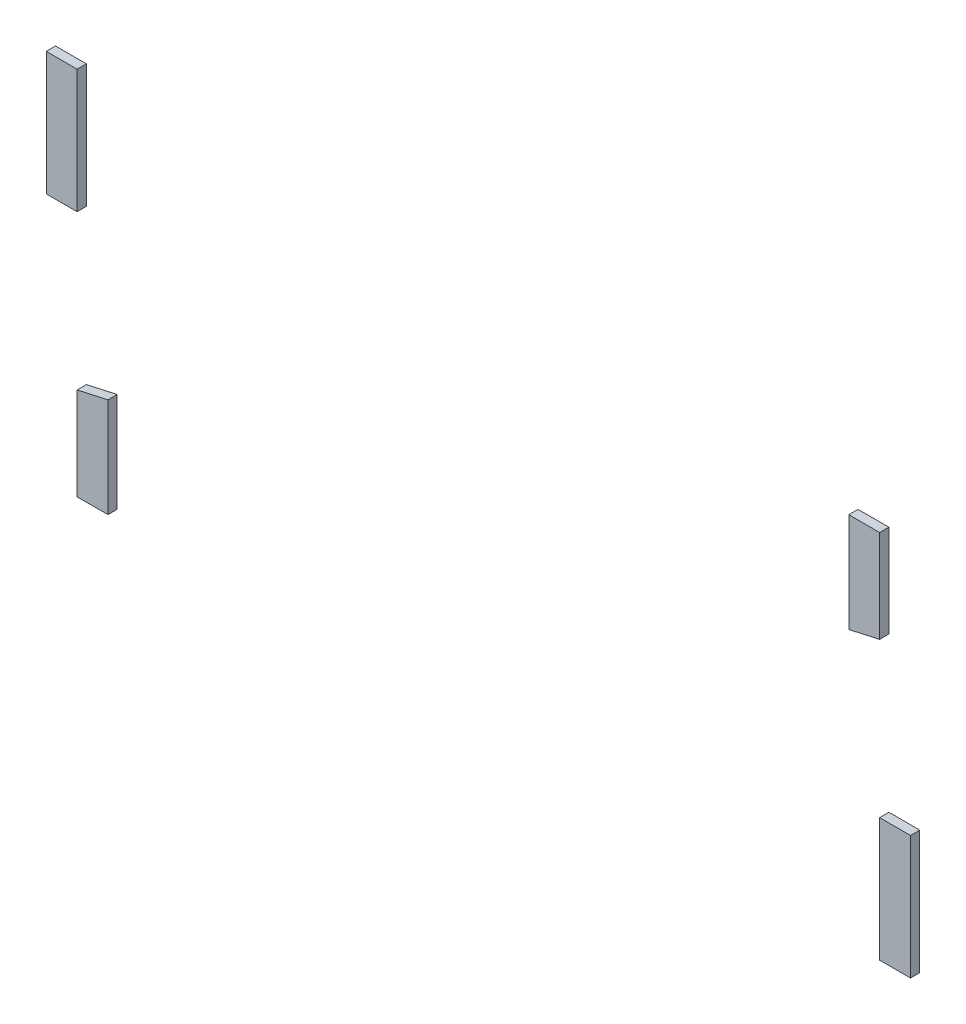
ISO-10303-21;
HEADER;
FILE_DESCRIPTION(('STEP AP214'),'2;1');
FILE_NAME('part.step','',(''),(''),'','','');
FILE_SCHEMA(('AUTOMOTIVE_DESIGN { 1 0 10303 214 1 1 1 1 }'));
ENDSEC;
DATA;
#1=APPLICATION_CONTEXT('core data for automotive mechanical design processes');
#2=APPLICATION_PROTOCOL_DEFINITION('international standard','automotive_design',2000,#1);
#3=PRODUCT_CONTEXT('',#1,'mechanical');
#4=PRODUCT('Part','Part','',(#3));
#5=PRODUCT_RELATED_PRODUCT_CATEGORY('part','',(#4));
#6=PRODUCT_DEFINITION_FORMATION('','',#4);
#7=PRODUCT_DEFINITION_CONTEXT('part definition',#1,'design');
#8=PRODUCT_DEFINITION('design','',#6,#7);
#9=PRODUCT_DEFINITION_SHAPE('','',#8);
#10=(LENGTH_UNIT() NAMED_UNIT(*) SI_UNIT(.MILLI.,.METRE.));
#11=(NAMED_UNIT(*) PLANE_ANGLE_UNIT() SI_UNIT($,.RADIAN.));
#12=(NAMED_UNIT(*) SI_UNIT($,.STERADIAN.) SOLID_ANGLE_UNIT());
#13=UNCERTAINTY_MEASURE_WITH_UNIT(LENGTH_MEASURE(1.E-05),#10,'distance_accuracy_value','');
#14=(GEOMETRIC_REPRESENTATION_CONTEXT(3) GLOBAL_UNCERTAINTY_ASSIGNED_CONTEXT((#13)) GLOBAL_UNIT_ASSIGNED_CONTEXT((#10,
#11,#12)) REPRESENTATION_CONTEXT('',''));
#15=CARTESIAN_POINT('',(0.,0.,0.));
#16=DIRECTION('',(0.,0.,1.));
#17=DIRECTION('',(1.,0.,0.));
#18=AXIS2_PLACEMENT_3D('',#15,#16,#17);
#19=CARTESIAN_POINT('',(32.5,-5.,0.75));
#20=DIRECTION('',(1.,0.,0.));
#21=DIRECTION('',(0.,0.,-1.));
#22=AXIS2_PLACEMENT_3D('',#19,#20,#21);
#23=PLANE('',#22);
#24=DIRECTION('',(0.,-1.,0.));
#25=VECTOR('',#24,1.);
#26=CARTESIAN_POINT('',(32.5,-5.,0.));
#27=LINE('',#26,#25);
#28=CARTESIAN_POINT('',(32.5,-5.,0.));
#29=VERTEX_POINT('',#28);
#30=CARTESIAN_POINT('',(32.5,-15.,0.));
#31=VERTEX_POINT('',#30);
#32=EDGE_CURVE('E107',#29,#31,#27,.T.);
#33=ORIENTED_EDGE('',*,*,#32,.T.);
#34=DIRECTION('',(0.,0.,-1.));
#35=VECTOR('',#34,1.);
#36=CARTESIAN_POINT('',(32.5,-15.,0.75));
#37=LINE('',#36,#35);
#38=CARTESIAN_POINT('',(32.5,-15.,0.75));
#39=VERTEX_POINT('',#38);
#40=EDGE_CURVE('E12',#39,#31,#37,.T.);
#41=ORIENTED_EDGE('',*,*,#40,.F.);
#42=DIRECTION('',(0.,-1.,0.));
#43=VECTOR('',#42,1.);
#44=CARTESIAN_POINT('',(32.5,-5.,0.75));
#45=LINE('',#44,#43);
#46=CARTESIAN_POINT('',(32.5,-5.,0.75));
#47=VERTEX_POINT('',#46);
#48=EDGE_CURVE('E95',#47,#39,#45,.T.);
#49=ORIENTED_EDGE('',*,*,#48,.F.);
#50=DIRECTION('',(0.,0.,-1.));
#51=VECTOR('',#50,1.);
#52=CARTESIAN_POINT('',(32.5,-5.,0.75));
#53=LINE('',#52,#51);
#54=EDGE_CURVE('E103',#47,#29,#53,.T.);
#55=ORIENTED_EDGE('',*,*,#54,.T.);
#56=EDGE_LOOP('',(#33,#41,#49,#55));
#57=FACE_BOUND('',#56,.T.);
#58=ADVANCED_FACE('F44',(#57),#23,.F.);
#59=CARTESIAN_POINT('',(32.5,-15.,0.75));
#60=DIRECTION('',(0.,1.,0.));
#61=DIRECTION('',(0.,0.,1.));
#62=AXIS2_PLACEMENT_3D('',#59,#60,#61);
#63=PLANE('',#62);
#64=DIRECTION('',(1.,0.,0.));
#65=VECTOR('',#64,1.);
#66=CARTESIAN_POINT('',(32.5,-15.,0.));
#67=LINE('',#66,#65);
#68=CARTESIAN_POINT('',(35.,-15.,0.));
#69=VERTEX_POINT('',#68);
#70=EDGE_CURVE('E99',#31,#69,#67,.T.);
#71=ORIENTED_EDGE('',*,*,#70,.T.);
#72=DIRECTION('',(0.,0.,-1.));
#73=VECTOR('',#72,1.);
#74=CARTESIAN_POINT('',(35.,-15.,0.75));
#75=LINE('',#74,#73);
#76=CARTESIAN_POINT('',(35.,-15.,0.75));
#77=VERTEX_POINT('',#76);
#78=EDGE_CURVE('E52',#77,#69,#75,.T.);
#79=ORIENTED_EDGE('',*,*,#78,.F.);
#80=DIRECTION('',(1.,0.,0.));
#81=VECTOR('',#80,1.);
#82=CARTESIAN_POINT('',(32.5,-15.,0.75));
#83=LINE('',#82,#81);
#84=EDGE_CURVE('E90',#39,#77,#83,.T.);
#85=ORIENTED_EDGE('',*,*,#84,.F.);
#86=ORIENTED_EDGE('',*,*,#40,.T.);
#87=EDGE_LOOP('',(#71,#79,#85,#86));
#88=FACE_BOUND('',#87,.T.);
#89=ADVANCED_FACE('F98',(#88),#63,.F.);
#90=CARTESIAN_POINT('',(35.,-5.,0.75));
#91=DIRECTION('',(-1.,0.,0.));
#92=DIRECTION('',(0.,0.,1.));
#93=AXIS2_PLACEMENT_3D('',#90,#91,#92);
#94=PLANE('',#93);
#95=DIRECTION('',(0.,1.,0.));
#96=VECTOR('',#95,1.);
#97=CARTESIAN_POINT('',(35.,-5.,0.));
#98=LINE('',#97,#96);
#99=CARTESIAN_POINT('',(35.,-5.,0.));
#100=VERTEX_POINT('',#99);
#101=EDGE_CURVE('E77',#69,#100,#98,.T.);
#102=ORIENTED_EDGE('',*,*,#101,.T.);
#103=DIRECTION('',(0.,0.,-1.));
#104=VECTOR('',#103,1.);
#105=CARTESIAN_POINT('',(35.,-5.,0.75));
#106=LINE('',#105,#104);
#107=CARTESIAN_POINT('',(35.,-5.,0.75));
#108=VERTEX_POINT('',#107);
#109=EDGE_CURVE('E100',#108,#100,#106,.T.);
#110=ORIENTED_EDGE('',*,*,#109,.F.);
#111=DIRECTION('',(0.,1.,0.));
#112=VECTOR('',#111,1.);
#113=CARTESIAN_POINT('',(35.,-5.,0.75));
#114=LINE('',#113,#112);
#115=EDGE_CURVE('E93',#77,#108,#114,.T.);
#116=ORIENTED_EDGE('',*,*,#115,.F.);
#117=ORIENTED_EDGE('',*,*,#78,.T.);
#118=EDGE_LOOP('',(#102,#110,#116,#117));
#119=FACE_BOUND('',#118,.T.);
#120=ADVANCED_FACE('F101',(#119),#94,.F.);
#121=CARTESIAN_POINT('',(32.5,-5.,0.75));
#122=DIRECTION('',(0.,-1.,0.));
#123=DIRECTION('',(0.,0.,-1.));
#124=AXIS2_PLACEMENT_3D('',#121,#122,#123);
#125=PLANE('',#124);
#126=DIRECTION('',(-1.,0.,0.));
#127=VECTOR('',#126,1.);
#128=CARTESIAN_POINT('',(32.5,-5.,0.));
#129=LINE('',#128,#127);
#130=EDGE_CURVE('E83',#100,#29,#129,.T.);
#131=ORIENTED_EDGE('',*,*,#130,.T.);
#132=ORIENTED_EDGE('',*,*,#54,.F.);
#133=DIRECTION('',(-1.,0.,0.));
#134=VECTOR('',#133,1.);
#135=CARTESIAN_POINT('',(32.5,-5.,0.75));
#136=LINE('',#135,#134);
#137=EDGE_CURVE('E60',#108,#47,#136,.T.);
#138=ORIENTED_EDGE('',*,*,#137,.F.);
#139=ORIENTED_EDGE('',*,*,#109,.T.);
#140=EDGE_LOOP('',(#131,#132,#138,#139));
#141=FACE_BOUND('',#140,.T.);
#142=ADVANCED_FACE('F114',(#141),#125,.F.);
#143=CARTESIAN_POINT('',(0.,0.,0.75));
#144=DIRECTION('',(0.,0.,1.));
#145=DIRECTION('',(1.,0.,0.));
#146=AXIS2_PLACEMENT_3D('',#143,#144,#145);
#147=PLANE('',#146);
#148=ORIENTED_EDGE('',*,*,#48,.T.);
#149=ORIENTED_EDGE('',*,*,#84,.T.);
#150=ORIENTED_EDGE('',*,*,#115,.T.);
#151=ORIENTED_EDGE('',*,*,#137,.T.);
#152=EDGE_LOOP('',(#148,#149,#150,#151));
#153=FACE_BOUND('',#152,.T.);
#154=ADVANCED_FACE('F91',(#153),#147,.T.);
#155=CARTESIAN_POINT('',(0.,0.,0.));
#156=DIRECTION('',(0.,0.,1.));
#157=DIRECTION('',(1.,0.,0.));
#158=AXIS2_PLACEMENT_3D('',#155,#156,#157);
#159=PLANE('',#158);
#160=ORIENTED_EDGE('',*,*,#32,.F.);
#161=ORIENTED_EDGE('',*,*,#130,.F.);
#162=ORIENTED_EDGE('',*,*,#101,.F.);
#163=ORIENTED_EDGE('',*,*,#70,.F.);
#164=EDGE_LOOP('',(#160,#161,#162,#163));
#165=FACE_BOUND('',#164,.T.);
#166=ADVANCED_FACE('F117',(#165),#159,.F.);
#167=CLOSED_SHELL('',(#58,#89,#120,#142,#154,#166));
#168=MANIFOLD_SOLID_BREP('B2',#167);
#169=CARTESIAN_POINT('',(-30.,-6.94444444444444,0.75));
#170=DIRECTION('',(-1.,0.,0.));
#171=DIRECTION('',(0.,-1.,0.));
#172=AXIS2_PLACEMENT_3D('',#169,#170,#171);
#173=PLANE('',#172);
#174=DIRECTION('',(0.,1.,0.));
#175=VECTOR('',#174,1.);
#176=CARTESIAN_POINT('',(-30.,-6.94444444444444,0.));
#177=LINE('',#176,#175);
#178=CARTESIAN_POINT('',(-30.,-15.,0.));
#179=VERTEX_POINT('',#178);
#180=CARTESIAN_POINT('',(-30.,-6.94444444444444,0.));
#181=VERTEX_POINT('',#180);
#182=EDGE_CURVE('E241',#179,#181,#177,.T.);
#183=ORIENTED_EDGE('',*,*,#182,.T.);
#184=DIRECTION('',(0.,0.,-1.));
#185=VECTOR('',#184,1.);
#186=CARTESIAN_POINT('',(-30.,-6.94444444444444,0.75));
#187=LINE('',#186,#185);
#188=CARTESIAN_POINT('',(-30.,-6.94444444444444,0.75));
#189=VERTEX_POINT('',#188);
#190=EDGE_CURVE('E42',#189,#181,#187,.T.);
#191=ORIENTED_EDGE('',*,*,#190,.F.);
#192=DIRECTION('',(0.,1.,0.));
#193=VECTOR('',#192,1.);
#194=CARTESIAN_POINT('',(-30.,-6.94444444444444,0.75));
#195=LINE('',#194,#193);
#196=CARTESIAN_POINT('',(-30.,-15.,0.75));
#197=VERTEX_POINT('',#196);
#198=EDGE_CURVE('E229',#197,#189,#195,.T.);
#199=ORIENTED_EDGE('',*,*,#198,.F.);
#200=DIRECTION('',(0.,0.,-1.));
#201=VECTOR('',#200,1.);
#202=CARTESIAN_POINT('',(-30.,-15.,0.75));
#203=LINE('',#202,#201);
#204=EDGE_CURVE('E237',#197,#179,#203,.T.);
#205=ORIENTED_EDGE('',*,*,#204,.T.);
#206=EDGE_LOOP('',(#183,#191,#199,#205));
#207=FACE_BOUND('',#206,.T.);
#208=ADVANCED_FACE('F178',(#207),#173,.F.);
#209=CARTESIAN_POINT('',(-30.,-6.94444444444444,0.75));
#210=DIRECTION('',(0.216930457818656,-0.976187060183953,0.));
#211=DIRECTION('',(0.976187060183953,0.216930457818656,0.));
#212=AXIS2_PLACEMENT_3D('',#209,#210,#211);
#213=PLANE('',#212);
#214=DIRECTION('',(-0.976187060183953,-0.216930457818656,0.));
#215=VECTOR('',#214,1.);
#216=CARTESIAN_POINT('',(-30.,-6.94444444444444,0.));
#217=LINE('',#216,#215);
#218=CARTESIAN_POINT('',(-32.5,-7.5,0.));
#219=VERTEX_POINT('',#218);
#220=EDGE_CURVE('E233',#181,#219,#217,.T.);
#221=ORIENTED_EDGE('',*,*,#220,.T.);
#222=DIRECTION('',(0.,0.,-1.));
#223=VECTOR('',#222,1.);
#224=CARTESIAN_POINT('',(-32.5,-7.5,0.75));
#225=LINE('',#224,#223);
#226=CARTESIAN_POINT('',(-32.5,-7.5,0.75));
#227=VERTEX_POINT('',#226);
#228=EDGE_CURVE('E186',#227,#219,#225,.T.);
#229=ORIENTED_EDGE('',*,*,#228,.F.);
#230=DIRECTION('',(-0.976187060183953,-0.216930457818656,0.));
#231=VECTOR('',#230,1.);
#232=CARTESIAN_POINT('',(-30.,-6.94444444444444,0.75));
#233=LINE('',#232,#231);
#234=EDGE_CURVE('E224',#189,#227,#233,.T.);
#235=ORIENTED_EDGE('',*,*,#234,.F.);
#236=ORIENTED_EDGE('',*,*,#190,.T.);
#237=EDGE_LOOP('',(#221,#229,#235,#236));
#238=FACE_BOUND('',#237,.T.);
#239=ADVANCED_FACE('F232',(#238),#213,.F.);
#240=CARTESIAN_POINT('',(-32.5,-7.5,0.75));
#241=DIRECTION('',(1.,0.,0.));
#242=DIRECTION('',(0.,0.,-1.));
#243=AXIS2_PLACEMENT_3D('',#240,#241,#242);
#244=PLANE('',#243);
#245=DIRECTION('',(0.,-1.,0.));
#246=VECTOR('',#245,1.);
#247=CARTESIAN_POINT('',(-32.5,-7.5,0.));
#248=LINE('',#247,#246);
#249=CARTESIAN_POINT('',(-32.5,-15.,0.));
#250=VERTEX_POINT('',#249);
#251=EDGE_CURVE('E211',#219,#250,#248,.T.);
#252=ORIENTED_EDGE('',*,*,#251,.T.);
#253=DIRECTION('',(0.,0.,-1.));
#254=VECTOR('',#253,1.);
#255=CARTESIAN_POINT('',(-32.5,-15.,0.75));
#256=LINE('',#255,#254);
#257=CARTESIAN_POINT('',(-32.5,-15.,0.75));
#258=VERTEX_POINT('',#257);
#259=EDGE_CURVE('E234',#258,#250,#256,.T.);
#260=ORIENTED_EDGE('',*,*,#259,.F.);
#261=DIRECTION('',(0.,-1.,0.));
#262=VECTOR('',#261,1.);
#263=CARTESIAN_POINT('',(-32.5,-7.5,0.75));
#264=LINE('',#263,#262);
#265=EDGE_CURVE('E227',#227,#258,#264,.T.);
#266=ORIENTED_EDGE('',*,*,#265,.F.);
#267=ORIENTED_EDGE('',*,*,#228,.T.);
#268=EDGE_LOOP('',(#252,#260,#266,#267));
#269=FACE_BOUND('',#268,.T.);
#270=ADVANCED_FACE('F235',(#269),#244,.F.);
#271=CARTESIAN_POINT('',(-32.5,-15.,0.75));
#272=DIRECTION('',(0.,1.,0.));
#273=DIRECTION('',(0.,0.,1.));
#274=AXIS2_PLACEMENT_3D('',#271,#272,#273);
#275=PLANE('',#274);
#276=DIRECTION('',(1.,0.,0.));
#277=VECTOR('',#276,1.);
#278=CARTESIAN_POINT('',(-32.5,-15.,0.));
#279=LINE('',#278,#277);
#280=EDGE_CURVE('E217',#250,#179,#279,.T.);
#281=ORIENTED_EDGE('',*,*,#280,.T.);
#282=ORIENTED_EDGE('',*,*,#204,.F.);
#283=DIRECTION('',(1.,0.,0.));
#284=VECTOR('',#283,1.);
#285=CARTESIAN_POINT('',(-32.5,-15.,0.75));
#286=LINE('',#285,#284);
#287=EDGE_CURVE('E194',#258,#197,#286,.T.);
#288=ORIENTED_EDGE('',*,*,#287,.F.);
#289=ORIENTED_EDGE('',*,*,#259,.T.);
#290=EDGE_LOOP('',(#281,#282,#288,#289));
#291=FACE_BOUND('',#290,.T.);
#292=ADVANCED_FACE('F248',(#291),#275,.F.);
#293=CARTESIAN_POINT('',(0.,0.,0.75));
#294=DIRECTION('',(0.,0.,1.));
#295=DIRECTION('',(1.,0.,0.));
#296=AXIS2_PLACEMENT_3D('',#293,#294,#295);
#297=PLANE('',#296);
#298=ORIENTED_EDGE('',*,*,#198,.T.);
#299=ORIENTED_EDGE('',*,*,#234,.T.);
#300=ORIENTED_EDGE('',*,*,#265,.T.);
#301=ORIENTED_EDGE('',*,*,#287,.T.);
#302=EDGE_LOOP('',(#298,#299,#300,#301));
#303=FACE_BOUND('',#302,.T.);
#304=ADVANCED_FACE('F225',(#303),#297,.T.);
#305=CARTESIAN_POINT('',(0.,0.,0.));
#306=DIRECTION('',(0.,0.,1.));
#307=DIRECTION('',(1.,0.,0.));
#308=AXIS2_PLACEMENT_3D('',#305,#306,#307);
#309=PLANE('',#308);
#310=ORIENTED_EDGE('',*,*,#182,.F.);
#311=ORIENTED_EDGE('',*,*,#280,.F.);
#312=ORIENTED_EDGE('',*,*,#251,.F.);
#313=ORIENTED_EDGE('',*,*,#220,.F.);
#314=EDGE_LOOP('',(#310,#311,#312,#313));
#315=FACE_BOUND('',#314,.T.);
#316=ADVANCED_FACE('F251',(#315),#309,.F.);
#317=CLOSED_SHELL('',(#208,#239,#270,#292,#304,#316));
#318=MANIFOLD_SOLID_BREP('B6',#317);
#319=CARTESIAN_POINT('',(30.,15.,0.75));
#320=DIRECTION('',(1.,0.,0.));
#321=DIRECTION('',(0.,0.,-1.));
#322=AXIS2_PLACEMENT_3D('',#319,#320,#321);
#323=PLANE('',#322);
#324=DIRECTION('',(0.,-1.,0.));
#325=VECTOR('',#324,1.);
#326=CARTESIAN_POINT('',(30.,15.,0.));
#327=LINE('',#326,#325);
#328=CARTESIAN_POINT('',(30.,15.,0.));
#329=VERTEX_POINT('',#328);
#330=CARTESIAN_POINT('',(30.,6.94444444444444,0.));
#331=VERTEX_POINT('',#330);
#332=EDGE_CURVE('E374',#329,#331,#327,.T.);
#333=ORIENTED_EDGE('',*,*,#332,.T.);
#334=DIRECTION('',(0.,0.,-1.));
#335=VECTOR('',#334,1.);
#336=CARTESIAN_POINT('',(30.,6.94444444444444,0.75));
#337=LINE('',#336,#335);
#338=CARTESIAN_POINT('',(30.,6.94444444444444,0.75));
#339=VERTEX_POINT('',#338);
#340=EDGE_CURVE('E176',#339,#331,#337,.T.);
#341=ORIENTED_EDGE('',*,*,#340,.F.);
#342=DIRECTION('',(0.,-1.,0.));
#343=VECTOR('',#342,1.);
#344=CARTESIAN_POINT('',(30.,15.,0.75));
#345=LINE('',#344,#343);
#346=CARTESIAN_POINT('',(30.,15.,0.75));
#347=VERTEX_POINT('',#346);
#348=EDGE_CURVE('E362',#347,#339,#345,.T.);
#349=ORIENTED_EDGE('',*,*,#348,.F.);
#350=DIRECTION('',(0.,0.,-1.));
#351=VECTOR('',#350,1.);
#352=CARTESIAN_POINT('',(30.,15.,0.75));
#353=LINE('',#352,#351);
#354=EDGE_CURVE('E370',#347,#329,#353,.T.);
#355=ORIENTED_EDGE('',*,*,#354,.T.);
#356=EDGE_LOOP('',(#333,#341,#349,#355));
#357=FACE_BOUND('',#356,.T.);
#358=ADVANCED_FACE('F311',(#357),#323,.F.);
#359=CARTESIAN_POINT('',(30.,6.94444444444444,0.75));
#360=DIRECTION('',(-0.216930457818656,0.976187060183953,0.));
#361=DIRECTION('',(-0.976187060183953,-0.216930457818656,0.));
#362=AXIS2_PLACEMENT_3D('',#359,#360,#361);
#363=PLANE('',#362);
#364=DIRECTION('',(0.976187060183953,0.216930457818656,0.));
#365=VECTOR('',#364,1.);
#366=CARTESIAN_POINT('',(30.,6.94444444444444,0.));
#367=LINE('',#366,#365);
#368=CARTESIAN_POINT('',(32.5,7.5,0.));
#369=VERTEX_POINT('',#368);
#370=EDGE_CURVE('E366',#331,#369,#367,.T.);
#371=ORIENTED_EDGE('',*,*,#370,.T.);
#372=DIRECTION('',(0.,0.,-1.));
#373=VECTOR('',#372,1.);
#374=CARTESIAN_POINT('',(32.5,7.5,0.75));
#375=LINE('',#374,#373);
#376=CARTESIAN_POINT('',(32.5,7.5,0.75));
#377=VERTEX_POINT('',#376);
#378=EDGE_CURVE('E319',#377,#369,#375,.T.);
#379=ORIENTED_EDGE('',*,*,#378,.F.);
#380=DIRECTION('',(0.976187060183953,0.216930457818656,0.));
#381=VECTOR('',#380,1.);
#382=CARTESIAN_POINT('',(30.,6.94444444444444,0.75));
#383=LINE('',#382,#381);
#384=EDGE_CURVE('E357',#339,#377,#383,.T.);
#385=ORIENTED_EDGE('',*,*,#384,.F.);
#386=ORIENTED_EDGE('',*,*,#340,.T.);
#387=EDGE_LOOP('',(#371,#379,#385,#386));
#388=FACE_BOUND('',#387,.T.);
#389=ADVANCED_FACE('F365',(#388),#363,.F.);
#390=CARTESIAN_POINT('',(32.5,15.,0.75));
#391=DIRECTION('',(-1.,0.,0.));
#392=DIRECTION('',(0.,0.,1.));
#393=AXIS2_PLACEMENT_3D('',#390,#391,#392);
#394=PLANE('',#393);
#395=DIRECTION('',(0.,1.,0.));
#396=VECTOR('',#395,1.);
#397=CARTESIAN_POINT('',(32.5,15.,0.));
#398=LINE('',#397,#396);
#399=CARTESIAN_POINT('',(32.5,15.,0.));
#400=VERTEX_POINT('',#399);
#401=EDGE_CURVE('E344',#369,#400,#398,.T.);
#402=ORIENTED_EDGE('',*,*,#401,.T.);
#403=DIRECTION('',(0.,0.,-1.));
#404=VECTOR('',#403,1.);
#405=CARTESIAN_POINT('',(32.5,15.,0.75));
#406=LINE('',#405,#404);
#407=CARTESIAN_POINT('',(32.5,15.,0.75));
#408=VERTEX_POINT('',#407);
#409=EDGE_CURVE('E367',#408,#400,#406,.T.);
#410=ORIENTED_EDGE('',*,*,#409,.F.);
#411=DIRECTION('',(0.,1.,0.));
#412=VECTOR('',#411,1.);
#413=CARTESIAN_POINT('',(32.5,15.,0.75));
#414=LINE('',#413,#412);
#415=EDGE_CURVE('E360',#377,#408,#414,.T.);
#416=ORIENTED_EDGE('',*,*,#415,.F.);
#417=ORIENTED_EDGE('',*,*,#378,.T.);
#418=EDGE_LOOP('',(#402,#410,#416,#417));
#419=FACE_BOUND('',#418,.T.);
#420=ADVANCED_FACE('F368',(#419),#394,.F.);
#421=CARTESIAN_POINT('',(30.,15.,0.75));
#422=DIRECTION('',(0.,-1.,0.));
#423=DIRECTION('',(0.,0.,-1.));
#424=AXIS2_PLACEMENT_3D('',#421,#422,#423);
#425=PLANE('',#424);
#426=DIRECTION('',(-1.,0.,0.));
#427=VECTOR('',#426,1.);
#428=CARTESIAN_POINT('',(30.,15.,0.));
#429=LINE('',#428,#427);
#430=EDGE_CURVE('E350',#400,#329,#429,.T.);
#431=ORIENTED_EDGE('',*,*,#430,.T.);
#432=ORIENTED_EDGE('',*,*,#354,.F.);
#433=DIRECTION('',(-1.,0.,0.));
#434=VECTOR('',#433,1.);
#435=CARTESIAN_POINT('',(30.,15.,0.75));
#436=LINE('',#435,#434);
#437=EDGE_CURVE('E327',#408,#347,#436,.T.);
#438=ORIENTED_EDGE('',*,*,#437,.F.);
#439=ORIENTED_EDGE('',*,*,#409,.T.);
#440=EDGE_LOOP('',(#431,#432,#438,#439));
#441=FACE_BOUND('',#440,.T.);
#442=ADVANCED_FACE('F381',(#441),#425,.F.);
#443=CARTESIAN_POINT('',(0.,0.,0.75));
#444=DIRECTION('',(0.,0.,1.));
#445=DIRECTION('',(1.,0.,0.));
#446=AXIS2_PLACEMENT_3D('',#443,#444,#445);
#447=PLANE('',#446);
#448=ORIENTED_EDGE('',*,*,#348,.T.);
#449=ORIENTED_EDGE('',*,*,#384,.T.);
#450=ORIENTED_EDGE('',*,*,#415,.T.);
#451=ORIENTED_EDGE('',*,*,#437,.T.);
#452=EDGE_LOOP('',(#448,#449,#450,#451));
#453=FACE_BOUND('',#452,.T.);
#454=ADVANCED_FACE('F358',(#453),#447,.T.);
#455=CARTESIAN_POINT('',(0.,0.,0.));
#456=DIRECTION('',(0.,0.,1.));
#457=DIRECTION('',(1.,0.,0.));
#458=AXIS2_PLACEMENT_3D('',#455,#456,#457);
#459=PLANE('',#458);
#460=ORIENTED_EDGE('',*,*,#332,.F.);
#461=ORIENTED_EDGE('',*,*,#430,.F.);
#462=ORIENTED_EDGE('',*,*,#401,.F.);
#463=ORIENTED_EDGE('',*,*,#370,.F.);
#464=EDGE_LOOP('',(#460,#461,#462,#463));
#465=FACE_BOUND('',#464,.T.);
#466=ADVANCED_FACE('F384',(#465),#459,.F.);
#467=CLOSED_SHELL('',(#358,#389,#420,#442,#454,#466));
#468=MANIFOLD_SOLID_BREP('B36',#467);
#469=CARTESIAN_POINT('',(-35.,15.,0.75));
#470=DIRECTION('',(1.,0.,0.));
#471=DIRECTION('',(0.,0.,-1.));
#472=AXIS2_PLACEMENT_3D('',#469,#470,#471);
#473=PLANE('',#472);
#474=DIRECTION('',(0.,-1.,0.));
#475=VECTOR('',#474,1.);
#476=CARTESIAN_POINT('',(-35.,15.,0.));
#477=LINE('',#476,#475);
#478=CARTESIAN_POINT('',(-35.,15.,0.));
#479=VERTEX_POINT('',#478);
#480=CARTESIAN_POINT('',(-35.,5.,0.));
#481=VERTEX_POINT('',#480);
#482=EDGE_CURVE('E498',#479,#481,#477,.T.);
#483=ORIENTED_EDGE('',*,*,#482,.T.);
#484=DIRECTION('',(0.,0.,-1.));
#485=VECTOR('',#484,1.);
#486=CARTESIAN_POINT('',(-35.,5.,0.75));
#487=LINE('',#486,#485);
#488=CARTESIAN_POINT('',(-35.,5.,0.75));
#489=VERTEX_POINT('',#488);
#490=EDGE_CURVE('E309',#489,#481,#487,.T.);
#491=ORIENTED_EDGE('',*,*,#490,.F.);
#492=DIRECTION('',(0.,-1.,0.));
#493=VECTOR('',#492,1.);
#494=CARTESIAN_POINT('',(-35.,15.,0.75));
#495=LINE('',#494,#493);
#496=CARTESIAN_POINT('',(-35.,15.,0.75));
#497=VERTEX_POINT('',#496);
#498=EDGE_CURVE('E486',#497,#489,#495,.T.);
#499=ORIENTED_EDGE('',*,*,#498,.F.);
#500=DIRECTION('',(0.,0.,-1.));
#501=VECTOR('',#500,1.);
#502=CARTESIAN_POINT('',(-35.,15.,0.75));
#503=LINE('',#502,#501);
#504=EDGE_CURVE('E494',#497,#479,#503,.T.);
#505=ORIENTED_EDGE('',*,*,#504,.T.);
#506=EDGE_LOOP('',(#483,#491,#499,#505));
#507=FACE_BOUND('',#506,.T.);
#508=ADVANCED_FACE('F435',(#507),#473,.F.);
#509=CARTESIAN_POINT('',(-35.,5.,0.75));
#510=DIRECTION('',(0.,1.,0.));
#511=DIRECTION('',(0.,0.,1.));
#512=AXIS2_PLACEMENT_3D('',#509,#510,#511);
#513=PLANE('',#512);
#514=DIRECTION('',(1.,0.,0.));
#515=VECTOR('',#514,1.);
#516=CARTESIAN_POINT('',(-35.,5.,0.));
#517=LINE('',#516,#515);
#518=CARTESIAN_POINT('',(-32.5,5.,0.));
#519=VERTEX_POINT('',#518);
#520=EDGE_CURVE('E490',#481,#519,#517,.T.);
#521=ORIENTED_EDGE('',*,*,#520,.T.);
#522=DIRECTION('',(0.,0.,-1.));
#523=VECTOR('',#522,1.);
#524=CARTESIAN_POINT('',(-32.5,5.,0.75));
#525=LINE('',#524,#523);
#526=CARTESIAN_POINT('',(-32.5,5.,0.75));
#527=VERTEX_POINT('',#526);
#528=EDGE_CURVE('E443',#527,#519,#525,.T.);
#529=ORIENTED_EDGE('',*,*,#528,.F.);
#530=DIRECTION('',(1.,0.,0.));
#531=VECTOR('',#530,1.);
#532=CARTESIAN_POINT('',(-35.,5.,0.75));
#533=LINE('',#532,#531);
#534=EDGE_CURVE('E481',#489,#527,#533,.T.);
#535=ORIENTED_EDGE('',*,*,#534,.F.);
#536=ORIENTED_EDGE('',*,*,#490,.T.);
#537=EDGE_LOOP('',(#521,#529,#535,#536));
#538=FACE_BOUND('',#537,.T.);
#539=ADVANCED_FACE('F489',(#538),#513,.F.);
#540=CARTESIAN_POINT('',(-32.5,15.,0.75));
#541=DIRECTION('',(-1.,0.,0.));
#542=DIRECTION('',(0.,0.,1.));
#543=AXIS2_PLACEMENT_3D('',#540,#541,#542);
#544=PLANE('',#543);
#545=DIRECTION('',(0.,1.,0.));
#546=VECTOR('',#545,1.);
#547=CARTESIAN_POINT('',(-32.5,15.,0.));
#548=LINE('',#547,#546);
#549=CARTESIAN_POINT('',(-32.5,15.,0.));
#550=VERTEX_POINT('',#549);
#551=EDGE_CURVE('E468',#519,#550,#548,.T.);
#552=ORIENTED_EDGE('',*,*,#551,.T.);
#553=DIRECTION('',(0.,0.,-1.));
#554=VECTOR('',#553,1.);
#555=CARTESIAN_POINT('',(-32.5,15.,0.75));
#556=LINE('',#555,#554);
#557=CARTESIAN_POINT('',(-32.5,15.,0.75));
#558=VERTEX_POINT('',#557);
#559=EDGE_CURVE('E491',#558,#550,#556,.T.);
#560=ORIENTED_EDGE('',*,*,#559,.F.);
#561=DIRECTION('',(0.,1.,0.));
#562=VECTOR('',#561,1.);
#563=CARTESIAN_POINT('',(-32.5,15.,0.75));
#564=LINE('',#563,#562);
#565=EDGE_CURVE('E484',#527,#558,#564,.T.);
#566=ORIENTED_EDGE('',*,*,#565,.F.);
#567=ORIENTED_EDGE('',*,*,#528,.T.);
#568=EDGE_LOOP('',(#552,#560,#566,#567));
#569=FACE_BOUND('',#568,.T.);
#570=ADVANCED_FACE('F492',(#569),#544,.F.);
#571=CARTESIAN_POINT('',(-35.,15.,0.75));
#572=DIRECTION('',(0.,-1.,0.));
#573=DIRECTION('',(0.,0.,-1.));
#574=AXIS2_PLACEMENT_3D('',#571,#572,#573);
#575=PLANE('',#574);
#576=DIRECTION('',(-1.,0.,0.));
#577=VECTOR('',#576,1.);
#578=CARTESIAN_POINT('',(-35.,15.,0.));
#579=LINE('',#578,#577);
#580=EDGE_CURVE('E474',#550,#479,#579,.T.);
#581=ORIENTED_EDGE('',*,*,#580,.T.);
#582=ORIENTED_EDGE('',*,*,#504,.F.);
#583=DIRECTION('',(-1.,0.,0.));
#584=VECTOR('',#583,1.);
#585=CARTESIAN_POINT('',(-35.,15.,0.75));
#586=LINE('',#585,#584);
#587=EDGE_CURVE('E451',#558,#497,#586,.T.);
#588=ORIENTED_EDGE('',*,*,#587,.F.);
#589=ORIENTED_EDGE('',*,*,#559,.T.);
#590=EDGE_LOOP('',(#581,#582,#588,#589));
#591=FACE_BOUND('',#590,.T.);
#592=ADVANCED_FACE('F505',(#591),#575,.F.);
#593=CARTESIAN_POINT('',(0.,0.,0.75));
#594=DIRECTION('',(0.,0.,1.));
#595=DIRECTION('',(1.,0.,0.));
#596=AXIS2_PLACEMENT_3D('',#593,#594,#595);
#597=PLANE('',#596);
#598=ORIENTED_EDGE('',*,*,#498,.T.);
#599=ORIENTED_EDGE('',*,*,#534,.T.);
#600=ORIENTED_EDGE('',*,*,#565,.T.);
#601=ORIENTED_EDGE('',*,*,#587,.T.);
#602=EDGE_LOOP('',(#598,#599,#600,#601));
#603=FACE_BOUND('',#602,.T.);
#604=ADVANCED_FACE('F482',(#603),#597,.T.);
#605=CARTESIAN_POINT('',(0.,0.,0.));
#606=DIRECTION('',(0.,0.,1.));
#607=DIRECTION('',(1.,0.,0.));
#608=AXIS2_PLACEMENT_3D('',#605,#606,#607);
#609=PLANE('',#608);
#610=ORIENTED_EDGE('',*,*,#482,.F.);
#611=ORIENTED_EDGE('',*,*,#580,.F.);
#612=ORIENTED_EDGE('',*,*,#551,.F.);
#613=ORIENTED_EDGE('',*,*,#520,.F.);
#614=EDGE_LOOP('',(#610,#611,#612,#613));
#615=FACE_BOUND('',#614,.T.);
#616=ADVANCED_FACE('F508',(#615),#609,.F.);
#617=CLOSED_SHELL('',(#508,#539,#570,#592,#604,#616));
#618=MANIFOLD_SOLID_BREP('B170',#617);
#619=ADVANCED_BREP_SHAPE_REPRESENTATION('',(#18,#168,#318,#468,#618),#14);
#620=SHAPE_DEFINITION_REPRESENTATION(#9,#619);
ENDSEC;
END-ISO-10303-21;
